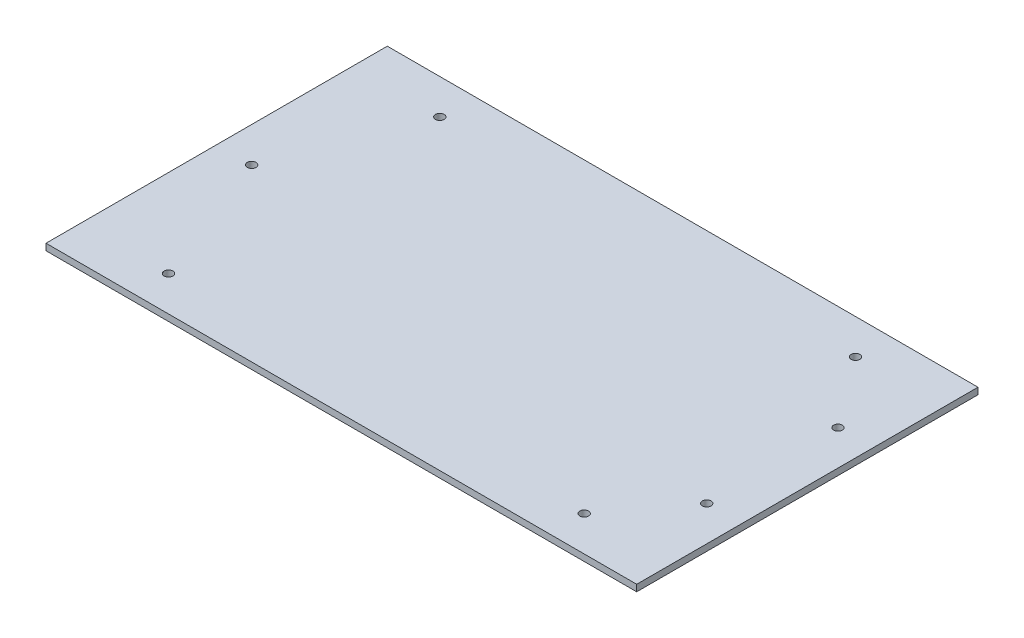
ISO-10303-21;
HEADER;
FILE_DESCRIPTION(('STEP AP214'),'2;1');
FILE_NAME('part.step','',(''),(''),'','','');
FILE_SCHEMA(('AUTOMOTIVE_DESIGN { 1 0 10303 214 1 1 1 1 }'));
ENDSEC;
DATA;
#1=APPLICATION_CONTEXT('core data for automotive mechanical design processes');
#2=APPLICATION_PROTOCOL_DEFINITION('international standard','automotive_design',2000,#1);
#3=PRODUCT_CONTEXT('',#1,'mechanical');
#4=PRODUCT('Part','Part','',(#3));
#5=PRODUCT_RELATED_PRODUCT_CATEGORY('part','',(#4));
#6=PRODUCT_DEFINITION_FORMATION('','',#4);
#7=PRODUCT_DEFINITION_CONTEXT('part definition',#1,'design');
#8=PRODUCT_DEFINITION('design','',#6,#7);
#9=PRODUCT_DEFINITION_SHAPE('','',#8);
#10=(LENGTH_UNIT() NAMED_UNIT(*) SI_UNIT(.MILLI.,.METRE.));
#11=(NAMED_UNIT(*) PLANE_ANGLE_UNIT() SI_UNIT($,.RADIAN.));
#12=(NAMED_UNIT(*) SI_UNIT($,.STERADIAN.) SOLID_ANGLE_UNIT());
#13=UNCERTAINTY_MEASURE_WITH_UNIT(LENGTH_MEASURE(1.E-05),#10,'distance_accuracy_value','');
#14=(GEOMETRIC_REPRESENTATION_CONTEXT(3) GLOBAL_UNCERTAINTY_ASSIGNED_CONTEXT((#13)) GLOBAL_UNIT_ASSIGNED_CONTEXT((#10,
#11,#12)) REPRESENTATION_CONTEXT('',''));
#15=CARTESIAN_POINT('',(0.,0.,0.));
#16=DIRECTION('',(0.,0.,1.));
#17=DIRECTION('',(1.,0.,0.));
#18=AXIS2_PLACEMENT_3D('',#15,#16,#17);
#19=CARTESIAN_POINT('',(135.,3.,-78.));
#20=DIRECTION('',(1.,0.,0.));
#21=DIRECTION('',(0.,0.,-1.));
#22=AXIS2_PLACEMENT_3D('',#19,#20,#21);
#23=PLANE('',#22);
#24=DIRECTION('',(0.,0.,1.));
#25=VECTOR('',#24,1.);
#26=CARTESIAN_POINT('',(135.,0.,-78.));
#27=LINE('',#26,#25);
#28=CARTESIAN_POINT('',(135.,0.,-78.));
#29=VERTEX_POINT('',#28);
#30=CARTESIAN_POINT('',(135.,0.,78.));
#31=VERTEX_POINT('',#30);
#32=EDGE_CURVE('E99',#29,#31,#27,.T.);
#33=ORIENTED_EDGE('',*,*,#32,.F.);
#34=DIRECTION('',(0.,-1.,0.));
#35=VECTOR('',#34,1.);
#36=CARTESIAN_POINT('',(135.,3.,-78.));
#37=LINE('',#36,#35);
#38=CARTESIAN_POINT('',(135.,3.,-78.));
#39=VERTEX_POINT('',#38);
#40=EDGE_CURVE('E11',#39,#29,#37,.T.);
#41=ORIENTED_EDGE('',*,*,#40,.F.);
#42=DIRECTION('',(0.,0.,1.));
#43=VECTOR('',#42,1.);
#44=CARTESIAN_POINT('',(135.,3.,-78.));
#45=LINE('',#44,#43);
#46=CARTESIAN_POINT('',(135.,3.,78.));
#47=VERTEX_POINT('',#46);
#48=EDGE_CURVE('E93',#39,#47,#45,.T.);
#49=ORIENTED_EDGE('',*,*,#48,.T.);
#50=DIRECTION('',(0.,-1.,0.));
#51=VECTOR('',#50,1.);
#52=CARTESIAN_POINT('',(135.,3.,78.));
#53=LINE('',#52,#51);
#54=EDGE_CURVE('E36',#47,#31,#53,.T.);
#55=ORIENTED_EDGE('',*,*,#54,.T.);
#56=EDGE_LOOP('',(#33,#41,#49,#55));
#57=FACE_BOUND('',#56,.T.);
#58=ADVANCED_FACE('F33',(#57),#23,.T.);
#59=CARTESIAN_POINT('',(135.,3.,-78.));
#60=DIRECTION('',(0.,0.,1.));
#61=DIRECTION('',(1.,0.,0.));
#62=AXIS2_PLACEMENT_3D('',#59,#60,#61);
#63=PLANE('',#62);
#64=DIRECTION('',(-1.,0.,0.));
#65=VECTOR('',#64,1.);
#66=CARTESIAN_POINT('',(135.,0.,-78.));
#67=LINE('',#66,#65);
#68=CARTESIAN_POINT('',(-135.,0.,-78.));
#69=VERTEX_POINT('',#68);
#70=EDGE_CURVE('E66',#29,#69,#67,.T.);
#71=ORIENTED_EDGE('',*,*,#70,.T.);
#72=DIRECTION('',(0.,-1.,0.));
#73=VECTOR('',#72,1.);
#74=CARTESIAN_POINT('',(-135.,3.,-78.));
#75=LINE('',#74,#73);
#76=CARTESIAN_POINT('',(-135.,3.,-78.));
#77=VERTEX_POINT('',#76);
#78=EDGE_CURVE('E42',#77,#69,#75,.T.);
#79=ORIENTED_EDGE('',*,*,#78,.F.);
#80=DIRECTION('',(-1.,0.,0.));
#81=VECTOR('',#80,1.);
#82=CARTESIAN_POINT('',(135.,3.,-78.));
#83=LINE('',#82,#81);
#84=EDGE_CURVE('E83',#39,#77,#83,.T.);
#85=ORIENTED_EDGE('',*,*,#84,.F.);
#86=ORIENTED_EDGE('',*,*,#40,.T.);
#87=EDGE_LOOP('',(#71,#79,#85,#86));
#88=FACE_BOUND('',#87,.T.);
#89=ADVANCED_FACE('F110',(#88),#63,.F.);
#90=CARTESIAN_POINT('',(-135.,3.,-78.));
#91=DIRECTION('',(1.,0.,0.));
#92=DIRECTION('',(0.,0.,-1.));
#93=AXIS2_PLACEMENT_3D('',#90,#91,#92);
#94=PLANE('',#93);
#95=DIRECTION('',(0.,0.,1.));
#96=VECTOR('',#95,1.);
#97=CARTESIAN_POINT('',(-135.,0.,-78.));
#98=LINE('',#97,#96);
#99=CARTESIAN_POINT('',(-135.,0.,78.));
#100=VERTEX_POINT('',#99);
#101=EDGE_CURVE('E90',#69,#100,#98,.T.);
#102=ORIENTED_EDGE('',*,*,#101,.T.);
#103=DIRECTION('',(0.,-1.,0.));
#104=VECTOR('',#103,1.);
#105=CARTESIAN_POINT('',(-135.,3.,78.));
#106=LINE('',#105,#104);
#107=CARTESIAN_POINT('',(-135.,3.,78.));
#108=VERTEX_POINT('',#107);
#109=EDGE_CURVE('E87',#108,#100,#106,.T.);
#110=ORIENTED_EDGE('',*,*,#109,.F.);
#111=DIRECTION('',(0.,0.,1.));
#112=VECTOR('',#111,1.);
#113=CARTESIAN_POINT('',(-135.,3.,-78.));
#114=LINE('',#113,#112);
#115=EDGE_CURVE('E78',#77,#108,#114,.T.);
#116=ORIENTED_EDGE('',*,*,#115,.F.);
#117=ORIENTED_EDGE('',*,*,#78,.T.);
#118=EDGE_LOOP('',(#102,#110,#116,#117));
#119=FACE_BOUND('',#118,.T.);
#120=ADVANCED_FACE('F88',(#119),#94,.F.);
#121=CARTESIAN_POINT('',(135.,3.,78.));
#122=DIRECTION('',(0.,0.,1.));
#123=DIRECTION('',(1.,0.,0.));
#124=AXIS2_PLACEMENT_3D('',#121,#122,#123);
#125=PLANE('',#124);
#126=DIRECTION('',(-1.,0.,0.));
#127=VECTOR('',#126,1.);
#128=CARTESIAN_POINT('',(135.,0.,78.));
#129=LINE('',#128,#127);
#130=EDGE_CURVE('E102',#31,#100,#129,.T.);
#131=ORIENTED_EDGE('',*,*,#130,.F.);
#132=ORIENTED_EDGE('',*,*,#54,.F.);
#133=DIRECTION('',(-1.,0.,0.));
#134=VECTOR('',#133,1.);
#135=CARTESIAN_POINT('',(135.,3.,78.));
#136=LINE('',#135,#134);
#137=EDGE_CURVE('E82',#47,#108,#136,.T.);
#138=ORIENTED_EDGE('',*,*,#137,.T.);
#139=ORIENTED_EDGE('',*,*,#109,.T.);
#140=EDGE_LOOP('',(#131,#132,#138,#139));
#141=FACE_BOUND('',#140,.T.);
#142=ADVANCED_FACE('F92',(#141),#125,.T.);
#143=CARTESIAN_POINT('',(0.,3.,0.));
#144=DIRECTION('',(0.,-1.,0.));
#145=DIRECTION('',(0.,0.,-1.));
#146=AXIS2_PLACEMENT_3D('',#143,#144,#145);
#147=PLANE('',#146);
#148=CARTESIAN_POINT('',(119.,3.,30.));
#149=DIRECTION('',(0.,1.,0.));
#150=DIRECTION('',(0.,0.,1.));
#151=AXIS2_PLACEMENT_3D('',#148,#149,#150);
#152=CIRCLE('',#151,2.);
#153=CARTESIAN_POINT('',(119.,3.,32.));
#154=VERTEX_POINT('',#153);
#155=EDGE_CURVE('E167',#154,#154,#152,.T.);
#156=ORIENTED_EDGE('',*,*,#155,.F.);
#157=EDGE_LOOP('',(#156));
#158=FACE_BOUND('',#157,.T.);
#159=CARTESIAN_POINT('',(119.,3.,-30.));
#160=DIRECTION('',(0.,1.,0.));
#161=DIRECTION('',(0.,0.,1.));
#162=AXIS2_PLACEMENT_3D('',#159,#160,#161);
#163=CIRCLE('',#162,2.);
#164=CARTESIAN_POINT('',(119.,3.,-28.));
#165=VERTEX_POINT('',#164);
#166=EDGE_CURVE('E171',#165,#165,#163,.T.);
#167=ORIENTED_EDGE('',*,*,#166,.F.);
#168=EDGE_LOOP('',(#167));
#169=FACE_BOUND('',#168,.T.);
#170=CARTESIAN_POINT('',(-95.,3.,62.));
#171=DIRECTION('',(0.,-1.,0.));
#172=DIRECTION('',(0.,0.,-1.));
#173=AXIS2_PLACEMENT_3D('',#170,#171,#172);
#174=CIRCLE('',#173,2.);
#175=CARTESIAN_POINT('',(-95.,3.,60.));
#176=VERTEX_POINT('',#175);
#177=EDGE_CURVE('E176',#176,#176,#174,.T.);
#178=ORIENTED_EDGE('',*,*,#177,.T.);
#179=EDGE_LOOP('',(#178));
#180=FACE_BOUND('',#179,.T.);
#181=CARTESIAN_POINT('',(95.,3.,62.));
#182=DIRECTION('',(0.,1.,0.));
#183=DIRECTION('',(0.,0.,-1.));
#184=AXIS2_PLACEMENT_3D('',#181,#182,#183);
#185=CIRCLE('',#184,2.);
#186=CARTESIAN_POINT('',(95.,3.,60.));
#187=VERTEX_POINT('',#186);
#188=EDGE_CURVE('E184',#187,#187,#185,.T.);
#189=ORIENTED_EDGE('',*,*,#188,.F.);
#190=EDGE_LOOP('',(#189));
#191=FACE_BOUND('',#190,.T.);
#192=CARTESIAN_POINT('',(95.,3.,-62.));
#193=DIRECTION('',(0.,-1.,0.));
#194=DIRECTION('',(0.,0.,1.));
#195=AXIS2_PLACEMENT_3D('',#192,#193,#194);
#196=CIRCLE('',#195,2.);
#197=CARTESIAN_POINT('',(95.,3.,-60.));
#198=VERTEX_POINT('',#197);
#199=EDGE_CURVE('E187',#198,#198,#196,.T.);
#200=ORIENTED_EDGE('',*,*,#199,.T.);
#201=EDGE_LOOP('',(#200));
#202=FACE_BOUND('',#201,.T.);
#203=CARTESIAN_POINT('',(-95.,3.,-62.));
#204=DIRECTION('',(0.,1.,0.));
#205=DIRECTION('',(0.,0.,1.));
#206=AXIS2_PLACEMENT_3D('',#203,#204,#205);
#207=CIRCLE('',#206,2.);
#208=CARTESIAN_POINT('',(-95.,3.,-60.));
#209=VERTEX_POINT('',#208);
#210=EDGE_CURVE('E196',#209,#209,#207,.T.);
#211=ORIENTED_EDGE('',*,*,#210,.F.);
#212=EDGE_LOOP('',(#211));
#213=FACE_BOUND('',#212,.T.);
#214=CARTESIAN_POINT('',(-119.,3.,0.));
#215=DIRECTION('',(0.,1.,0.));
#216=DIRECTION('',(0.,0.,1.));
#217=AXIS2_PLACEMENT_3D('',#214,#215,#216);
#218=CIRCLE('',#217,2.);
#219=CARTESIAN_POINT('',(-119.,3.,2.));
#220=VERTEX_POINT('',#219);
#221=EDGE_CURVE('E103',#220,#220,#218,.T.);
#222=ORIENTED_EDGE('',*,*,#221,.F.);
#223=EDGE_LOOP('',(#222));
#224=FACE_BOUND('',#223,.T.);
#225=ORIENTED_EDGE('',*,*,#48,.F.);
#226=ORIENTED_EDGE('',*,*,#84,.T.);
#227=ORIENTED_EDGE('',*,*,#115,.T.);
#228=ORIENTED_EDGE('',*,*,#137,.F.);
#229=EDGE_LOOP('',(#225,#226,#227,#228));
#230=FACE_BOUND('',#229,.T.);
#231=ADVANCED_FACE('F81',(#158,#169,#180,#191,#202,#213,#224,#230),#147,.F.);
#232=CARTESIAN_POINT('',(0.,0.,0.));
#233=DIRECTION('',(0.,-1.,0.));
#234=DIRECTION('',(0.,0.,-1.));
#235=AXIS2_PLACEMENT_3D('',#232,#233,#234);
#236=PLANE('',#235);
#237=CARTESIAN_POINT('',(119.,0.,30.));
#238=DIRECTION('',(0.,-1.,0.));
#239=DIRECTION('',(0.,0.,-1.));
#240=AXIS2_PLACEMENT_3D('',#237,#238,#239);
#241=CIRCLE('',#240,2.);
#242=CARTESIAN_POINT('',(119.,0.,28.));
#243=VERTEX_POINT('',#242);
#244=EDGE_CURVE('E165',#243,#243,#241,.F.);
#245=ORIENTED_EDGE('',*,*,#244,.T.);
#246=EDGE_LOOP('',(#245));
#247=FACE_BOUND('',#246,.T.);
#248=CARTESIAN_POINT('',(119.,0.,-30.));
#249=DIRECTION('',(0.,-1.,0.));
#250=DIRECTION('',(0.,0.,-1.));
#251=AXIS2_PLACEMENT_3D('',#248,#249,#250);
#252=CIRCLE('',#251,2.);
#253=CARTESIAN_POINT('',(119.,0.,-32.));
#254=VERTEX_POINT('',#253);
#255=EDGE_CURVE('E168',#254,#254,#252,.F.);
#256=ORIENTED_EDGE('',*,*,#255,.T.);
#257=EDGE_LOOP('',(#256));
#258=FACE_BOUND('',#257,.T.);
#259=CARTESIAN_POINT('',(-95.,0.,62.));
#260=DIRECTION('',(0.,-1.,0.));
#261=DIRECTION('',(0.,0.,-1.));
#262=AXIS2_PLACEMENT_3D('',#259,#260,#261);
#263=CIRCLE('',#262,2.);
#264=CARTESIAN_POINT('',(-95.,0.,60.));
#265=VERTEX_POINT('',#264);
#266=EDGE_CURVE('E180',#265,#265,#263,.T.);
#267=ORIENTED_EDGE('',*,*,#266,.F.);
#268=EDGE_LOOP('',(#267));
#269=FACE_BOUND('',#268,.T.);
#270=CARTESIAN_POINT('',(95.,0.,62.));
#271=DIRECTION('',(0.,-1.,0.));
#272=DIRECTION('',(0.,0.,-1.));
#273=AXIS2_PLACEMENT_3D('',#270,#271,#272);
#274=CIRCLE('',#273,2.);
#275=CARTESIAN_POINT('',(95.,0.,60.));
#276=VERTEX_POINT('',#275);
#277=EDGE_CURVE('E183',#276,#276,#274,.F.);
#278=ORIENTED_EDGE('',*,*,#277,.T.);
#279=EDGE_LOOP('',(#278));
#280=FACE_BOUND('',#279,.T.);
#281=CARTESIAN_POINT('',(95.,0.,-62.));
#282=DIRECTION('',(0.,-1.,0.));
#283=DIRECTION('',(0.,0.,-1.));
#284=AXIS2_PLACEMENT_3D('',#281,#282,#283);
#285=CIRCLE('',#284,2.);
#286=CARTESIAN_POINT('',(95.,0.,-64.));
#287=VERTEX_POINT('',#286);
#288=EDGE_CURVE('E192',#287,#287,#285,.T.);
#289=ORIENTED_EDGE('',*,*,#288,.F.);
#290=EDGE_LOOP('',(#289));
#291=FACE_BOUND('',#290,.T.);
#292=CARTESIAN_POINT('',(-95.,0.,-62.));
#293=DIRECTION('',(0.,-1.,0.));
#294=DIRECTION('',(0.,0.,-1.));
#295=AXIS2_PLACEMENT_3D('',#292,#293,#294);
#296=CIRCLE('',#295,2.);
#297=CARTESIAN_POINT('',(-95.,0.,-64.));
#298=VERTEX_POINT('',#297);
#299=EDGE_CURVE('E195',#298,#298,#296,.F.);
#300=ORIENTED_EDGE('',*,*,#299,.T.);
#301=EDGE_LOOP('',(#300));
#302=FACE_BOUND('',#301,.T.);
#303=CARTESIAN_POINT('',(-119.,0.,0.));
#304=DIRECTION('',(0.,-1.,0.));
#305=DIRECTION('',(0.,0.,-1.));
#306=AXIS2_PLACEMENT_3D('',#303,#304,#305);
#307=CIRCLE('',#306,2.);
#308=CARTESIAN_POINT('',(-119.,0.,-2.));
#309=VERTEX_POINT('',#308);
#310=EDGE_CURVE('E199',#309,#309,#307,.F.);
#311=ORIENTED_EDGE('',*,*,#310,.T.);
#312=EDGE_LOOP('',(#311));
#313=FACE_BOUND('',#312,.T.);
#314=ORIENTED_EDGE('',*,*,#32,.T.);
#315=ORIENTED_EDGE('',*,*,#130,.T.);
#316=ORIENTED_EDGE('',*,*,#101,.F.);
#317=ORIENTED_EDGE('',*,*,#70,.F.);
#318=EDGE_LOOP('',(#314,#315,#316,#317));
#319=FACE_BOUND('',#318,.T.);
#320=ADVANCED_FACE('F108',(#247,#258,#269,#280,#291,#302,#313,#319),#236,.T.);
#321=CARTESIAN_POINT('',(-119.,-0.00100000000000013,0.));
#322=DIRECTION('',(0.,1.,0.));
#323=DIRECTION('',(0.,0.,1.));
#324=AXIS2_PLACEMENT_3D('',#321,#322,#323);
#325=CYLINDRICAL_SURFACE('',#324,2.);
#326=ORIENTED_EDGE('',*,*,#310,.F.);
#327=EDGE_LOOP('',(#326));
#328=FACE_BOUND('',#327,.T.);
#329=ORIENTED_EDGE('',*,*,#221,.T.);
#330=EDGE_LOOP('',(#329));
#331=FACE_BOUND('',#330,.T.);
#332=ADVANCED_FACE('F129',(#328,#331),#325,.F.);
#333=CARTESIAN_POINT('',(-95.,-0.00100000000000013,-62.));
#334=DIRECTION('',(0.,1.,0.));
#335=DIRECTION('',(0.,0.,1.));
#336=AXIS2_PLACEMENT_3D('',#333,#334,#335);
#337=CYLINDRICAL_SURFACE('',#336,2.);
#338=ORIENTED_EDGE('',*,*,#299,.F.);
#339=EDGE_LOOP('',(#338));
#340=FACE_BOUND('',#339,.T.);
#341=ORIENTED_EDGE('',*,*,#210,.T.);
#342=EDGE_LOOP('',(#341));
#343=FACE_BOUND('',#342,.T.);
#344=ADVANCED_FACE('F136',(#340,#343),#337,.F.);
#345=CARTESIAN_POINT('',(95.,-0.00100000000000013,-62.));
#346=DIRECTION('',(0.,1.,0.));
#347=DIRECTION('',(0.,0.,1.));
#348=AXIS2_PLACEMENT_3D('',#345,#346,#347);
#349=CYLINDRICAL_SURFACE('',#348,2.);
#350=ORIENTED_EDGE('',*,*,#288,.T.);
#351=EDGE_LOOP('',(#350));
#352=FACE_BOUND('',#351,.T.);
#353=ORIENTED_EDGE('',*,*,#199,.F.);
#354=EDGE_LOOP('',(#353));
#355=FACE_BOUND('',#354,.T.);
#356=ADVANCED_FACE('F140',(#352,#355),#349,.F.);
#357=CARTESIAN_POINT('',(95.,-0.00100000000000013,62.));
#358=DIRECTION('',(0.,1.,0.));
#359=DIRECTION('',(0.,0.,1.));
#360=AXIS2_PLACEMENT_3D('',#357,#358,#359);
#361=CYLINDRICAL_SURFACE('',#360,2.);
#362=ORIENTED_EDGE('',*,*,#277,.F.);
#363=EDGE_LOOP('',(#362));
#364=FACE_BOUND('',#363,.T.);
#365=ORIENTED_EDGE('',*,*,#188,.T.);
#366=EDGE_LOOP('',(#365));
#367=FACE_BOUND('',#366,.T.);
#368=ADVANCED_FACE('F144',(#364,#367),#361,.F.);
#369=CARTESIAN_POINT('',(-95.,-0.00100000000000013,62.));
#370=DIRECTION('',(0.,1.,0.));
#371=DIRECTION('',(0.,0.,1.));
#372=AXIS2_PLACEMENT_3D('',#369,#370,#371);
#373=CYLINDRICAL_SURFACE('',#372,2.);
#374=ORIENTED_EDGE('',*,*,#266,.T.);
#375=EDGE_LOOP('',(#374));
#376=FACE_BOUND('',#375,.T.);
#377=ORIENTED_EDGE('',*,*,#177,.F.);
#378=EDGE_LOOP('',(#377));
#379=FACE_BOUND('',#378,.T.);
#380=ADVANCED_FACE('F148',(#376,#379),#373,.F.);
#381=CARTESIAN_POINT('',(119.,-0.00100000000000013,-30.));
#382=DIRECTION('',(0.,1.,0.));
#383=DIRECTION('',(0.,0.,1.));
#384=AXIS2_PLACEMENT_3D('',#381,#382,#383);
#385=CYLINDRICAL_SURFACE('',#384,2.);
#386=ORIENTED_EDGE('',*,*,#255,.F.);
#387=EDGE_LOOP('',(#386));
#388=FACE_BOUND('',#387,.T.);
#389=ORIENTED_EDGE('',*,*,#166,.T.);
#390=EDGE_LOOP('',(#389));
#391=FACE_BOUND('',#390,.T.);
#392=ADVANCED_FACE('F152',(#388,#391),#385,.F.);
#393=CARTESIAN_POINT('',(119.,-0.00100000000000013,30.));
#394=DIRECTION('',(0.,1.,0.));
#395=DIRECTION('',(0.,0.,1.));
#396=AXIS2_PLACEMENT_3D('',#393,#394,#395);
#397=CYLINDRICAL_SURFACE('',#396,2.);
#398=ORIENTED_EDGE('',*,*,#244,.F.);
#399=EDGE_LOOP('',(#398));
#400=FACE_BOUND('',#399,.T.);
#401=ORIENTED_EDGE('',*,*,#155,.T.);
#402=EDGE_LOOP('',(#401));
#403=FACE_BOUND('',#402,.T.);
#404=ADVANCED_FACE('F156',(#400,#403),#397,.F.);
#405=CLOSED_SHELL('',(#58,#89,#120,#142,#231,#320,#332,#344,#356,#368,#380,#392,#404));
#406=MANIFOLD_SOLID_BREP('B2',#405);
#407=ADVANCED_BREP_SHAPE_REPRESENTATION('',(#18,#406),#14);
#408=SHAPE_DEFINITION_REPRESENTATION(#9,#407);
ENDSEC;
END-ISO-10303-21;
